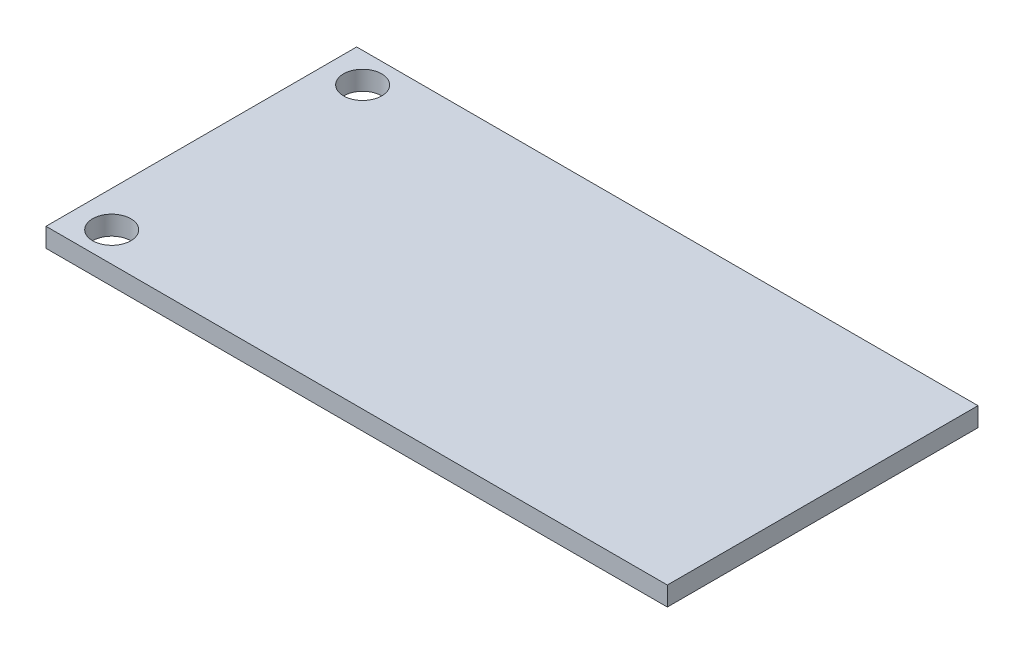
ISO-10303-21;
HEADER;
FILE_DESCRIPTION(('STEP AP214'),'2;1');
FILE_NAME('part.step','',(''),(''),'','','');
FILE_SCHEMA(('AUTOMOTIVE_DESIGN { 1 0 10303 214 1 1 1 1 }'));
ENDSEC;
DATA;
#1=APPLICATION_CONTEXT('core data for automotive mechanical design processes');
#2=APPLICATION_PROTOCOL_DEFINITION('international standard','automotive_design',2000,#1);
#3=PRODUCT_CONTEXT('',#1,'mechanical');
#4=PRODUCT('Part','Part','',(#3));
#5=PRODUCT_RELATED_PRODUCT_CATEGORY('part','',(#4));
#6=PRODUCT_DEFINITION_FORMATION('','',#4);
#7=PRODUCT_DEFINITION_CONTEXT('part definition',#1,'design');
#8=PRODUCT_DEFINITION('design','',#6,#7);
#9=PRODUCT_DEFINITION_SHAPE('','',#8);
#10=(LENGTH_UNIT() NAMED_UNIT(*) SI_UNIT(.MILLI.,.METRE.));
#11=(NAMED_UNIT(*) PLANE_ANGLE_UNIT() SI_UNIT($,.RADIAN.));
#12=(NAMED_UNIT(*) SI_UNIT($,.STERADIAN.) SOLID_ANGLE_UNIT());
#13=UNCERTAINTY_MEASURE_WITH_UNIT(LENGTH_MEASURE(1.E-05),#10,'distance_accuracy_value','');
#14=(GEOMETRIC_REPRESENTATION_CONTEXT(3) GLOBAL_UNCERTAINTY_ASSIGNED_CONTEXT((#13)) GLOBAL_UNIT_ASSIGNED_CONTEXT((#10,
#11,#12)) REPRESENTATION_CONTEXT('',''));
#15=CARTESIAN_POINT('',(0.,0.,0.));
#16=DIRECTION('',(0.,0.,1.));
#17=DIRECTION('',(1.,0.,0.));
#18=AXIS2_PLACEMENT_3D('',#15,#16,#17);
#19=CARTESIAN_POINT('',(0.,1.6,0.));
#20=DIRECTION('',(0.,-1.,0.));
#21=DIRECTION('',(0.,0.,-1.));
#22=AXIS2_PLACEMENT_3D('',#19,#20,#21);
#23=PLANE('',#22);
#24=CARTESIAN_POINT('',(3.,1.6,-23.5));
#25=DIRECTION('',(0.,1.,0.));
#26=DIRECTION('',(0.,0.,1.));
#27=AXIS2_PLACEMENT_3D('',#24,#25,#26);
#28=CIRCLE('',#27,1.6);
#29=CARTESIAN_POINT('',(3.,1.6,-21.9));
#30=VERTEX_POINT('',#29);
#31=EDGE_CURVE('E100',#30,#30,#28,.T.);
#32=ORIENTED_EDGE('',*,*,#31,.F.);
#33=EDGE_LOOP('',(#32));
#34=FACE_BOUND('',#33,.T.);
#35=DIRECTION('',(0.,0.,1.));
#36=VECTOR('',#35,1.);
#37=CARTESIAN_POINT('',(0.,1.6,0.));
#38=LINE('',#37,#36);
#39=CARTESIAN_POINT('',(0.,1.6,-26.));
#40=VERTEX_POINT('',#39);
#41=CARTESIAN_POINT('',(0.,1.6,0.));
#42=VERTEX_POINT('',#41);
#43=EDGE_CURVE('E85',#40,#42,#38,.T.);
#44=ORIENTED_EDGE('',*,*,#43,.T.);
#45=DIRECTION('',(1.,0.,0.));
#46=VECTOR('',#45,1.);
#47=CARTESIAN_POINT('',(0.,1.6,0.));
#48=LINE('',#47,#46);
#49=CARTESIAN_POINT('',(52.,1.6,0.));
#50=VERTEX_POINT('',#49);
#51=EDGE_CURVE('E80',#42,#50,#48,.T.);
#52=ORIENTED_EDGE('',*,*,#51,.T.);
#53=DIRECTION('',(0.,0.,-1.));
#54=VECTOR('',#53,1.);
#55=CARTESIAN_POINT('',(52.,1.6,0.));
#56=LINE('',#55,#54);
#57=CARTESIAN_POINT('',(52.,1.6,-26.));
#58=VERTEX_POINT('',#57);
#59=EDGE_CURVE('E83',#50,#58,#56,.T.);
#60=ORIENTED_EDGE('',*,*,#59,.T.);
#61=DIRECTION('',(-1.,0.,0.));
#62=VECTOR('',#61,1.);
#63=CARTESIAN_POINT('',(0.,1.6,-26.));
#64=LINE('',#63,#62);
#65=EDGE_CURVE('E50',#58,#40,#64,.T.);
#66=ORIENTED_EDGE('',*,*,#65,.T.);
#67=EDGE_LOOP('',(#44,#52,#60,#66));
#68=FACE_BOUND('',#67,.T.);
#69=CARTESIAN_POINT('',(3.,1.6,-2.5));
#70=DIRECTION('',(0.,1.,0.));
#71=DIRECTION('',(0.,0.,1.));
#72=AXIS2_PLACEMENT_3D('',#69,#70,#71);
#73=CIRCLE('',#72,1.6);
#74=CARTESIAN_POINT('',(3.,1.6,-0.9));
#75=VERTEX_POINT('',#74);
#76=EDGE_CURVE('E115',#75,#75,#73,.T.);
#77=ORIENTED_EDGE('',*,*,#76,.F.);
#78=EDGE_LOOP('',(#77));
#79=FACE_BOUND('',#78,.T.);
#80=ADVANCED_FACE('F33',(#34,#68,#79),#23,.F.);
#81=CARTESIAN_POINT('',(0.,0.,0.));
#82=DIRECTION('',(0.,-1.,0.));
#83=DIRECTION('',(0.,0.,-1.));
#84=AXIS2_PLACEMENT_3D('',#81,#82,#83);
#85=PLANE('',#84);
#86=CARTESIAN_POINT('',(3.,0.,-23.5));
#87=DIRECTION('',(0.,1.,0.));
#88=DIRECTION('',(0.,0.,1.));
#89=AXIS2_PLACEMENT_3D('',#86,#87,#88);
#90=CIRCLE('',#89,1.6);
#91=CARTESIAN_POINT('',(3.,0.,-21.9));
#92=VERTEX_POINT('',#91);
#93=EDGE_CURVE('E112',#92,#92,#90,.T.);
#94=ORIENTED_EDGE('',*,*,#93,.T.);
#95=EDGE_LOOP('',(#94));
#96=FACE_BOUND('',#95,.T.);
#97=DIRECTION('',(0.,0.,1.));
#98=VECTOR('',#97,1.);
#99=CARTESIAN_POINT('',(0.,0.,0.));
#100=LINE('',#99,#98);
#101=CARTESIAN_POINT('',(0.,0.,-26.));
#102=VERTEX_POINT('',#101);
#103=CARTESIAN_POINT('',(0.,0.,0.));
#104=VERTEX_POINT('',#103);
#105=EDGE_CURVE('E97',#102,#104,#100,.T.);
#106=ORIENTED_EDGE('',*,*,#105,.F.);
#107=DIRECTION('',(-1.,0.,0.));
#108=VECTOR('',#107,1.);
#109=CARTESIAN_POINT('',(0.,0.,-26.));
#110=LINE('',#109,#108);
#111=CARTESIAN_POINT('',(52.,0.,-26.));
#112=VERTEX_POINT('',#111);
#113=EDGE_CURVE('E73',#112,#102,#110,.T.);
#114=ORIENTED_EDGE('',*,*,#113,.F.);
#115=DIRECTION('',(0.,0.,-1.));
#116=VECTOR('',#115,1.);
#117=CARTESIAN_POINT('',(52.,0.,0.));
#118=LINE('',#117,#116);
#119=CARTESIAN_POINT('',(52.,0.,0.));
#120=VERTEX_POINT('',#119);
#121=EDGE_CURVE('E67',#120,#112,#118,.T.);
#122=ORIENTED_EDGE('',*,*,#121,.F.);
#123=DIRECTION('',(1.,0.,0.));
#124=VECTOR('',#123,1.);
#125=CARTESIAN_POINT('',(0.,0.,0.));
#126=LINE('',#125,#124);
#127=EDGE_CURVE('E89',#104,#120,#126,.T.);
#128=ORIENTED_EDGE('',*,*,#127,.F.);
#129=EDGE_LOOP('',(#106,#114,#122,#128));
#130=FACE_BOUND('',#129,.T.);
#131=CARTESIAN_POINT('',(3.,0.,-2.5));
#132=DIRECTION('',(0.,1.,0.));
#133=DIRECTION('',(0.,0.,1.));
#134=AXIS2_PLACEMENT_3D('',#131,#132,#133);
#135=CIRCLE('',#134,1.6);
#136=CARTESIAN_POINT('',(3.,0.,-0.9));
#137=VERTEX_POINT('',#136);
#138=EDGE_CURVE('E118',#137,#137,#135,.T.);
#139=ORIENTED_EDGE('',*,*,#138,.T.);
#140=EDGE_LOOP('',(#139));
#141=FACE_BOUND('',#140,.T.);
#142=ADVANCED_FACE('F108',(#96,#130,#141),#85,.T.);
#143=CARTESIAN_POINT('',(0.,1.6,0.));
#144=DIRECTION('',(1.,0.,0.));
#145=DIRECTION('',(0.,0.,-1.));
#146=AXIS2_PLACEMENT_3D('',#143,#144,#145);
#147=PLANE('',#146);
#148=ORIENTED_EDGE('',*,*,#105,.T.);
#149=DIRECTION('',(0.,-1.,0.));
#150=VECTOR('',#149,1.);
#151=CARTESIAN_POINT('',(0.,1.6,0.));
#152=LINE('',#151,#150);
#153=EDGE_CURVE('E11',#42,#104,#152,.T.);
#154=ORIENTED_EDGE('',*,*,#153,.F.);
#155=ORIENTED_EDGE('',*,*,#43,.F.);
#156=DIRECTION('',(0.,-1.,0.));
#157=VECTOR('',#156,1.);
#158=CARTESIAN_POINT('',(0.,1.6,-26.));
#159=LINE('',#158,#157);
#160=EDGE_CURVE('E93',#40,#102,#159,.T.);
#161=ORIENTED_EDGE('',*,*,#160,.T.);
#162=EDGE_LOOP('',(#148,#154,#155,#161));
#163=FACE_BOUND('',#162,.T.);
#164=ADVANCED_FACE('F35',(#163),#147,.F.);
#165=CARTESIAN_POINT('',(0.,1.6,0.));
#166=DIRECTION('',(0.,0.,-1.));
#167=DIRECTION('',(-1.,0.,0.));
#168=AXIS2_PLACEMENT_3D('',#165,#166,#167);
#169=PLANE('',#168);
#170=ORIENTED_EDGE('',*,*,#127,.T.);
#171=DIRECTION('',(0.,-1.,0.));
#172=VECTOR('',#171,1.);
#173=CARTESIAN_POINT('',(52.,1.6,0.));
#174=LINE('',#173,#172);
#175=EDGE_CURVE('E42',#50,#120,#174,.T.);
#176=ORIENTED_EDGE('',*,*,#175,.F.);
#177=ORIENTED_EDGE('',*,*,#51,.F.);
#178=ORIENTED_EDGE('',*,*,#153,.T.);
#179=EDGE_LOOP('',(#170,#176,#177,#178));
#180=FACE_BOUND('',#179,.T.);
#181=ADVANCED_FACE('F88',(#180),#169,.F.);
#182=CARTESIAN_POINT('',(52.,1.6,0.));
#183=DIRECTION('',(-1.,0.,0.));
#184=DIRECTION('',(0.,0.,1.));
#185=AXIS2_PLACEMENT_3D('',#182,#183,#184);
#186=PLANE('',#185);
#187=ORIENTED_EDGE('',*,*,#121,.T.);
#188=DIRECTION('',(0.,-1.,0.));
#189=VECTOR('',#188,1.);
#190=CARTESIAN_POINT('',(52.,1.6,-26.));
#191=LINE('',#190,#189);
#192=EDGE_CURVE('E90',#58,#112,#191,.T.);
#193=ORIENTED_EDGE('',*,*,#192,.F.);
#194=ORIENTED_EDGE('',*,*,#59,.F.);
#195=ORIENTED_EDGE('',*,*,#175,.T.);
#196=EDGE_LOOP('',(#187,#193,#194,#195));
#197=FACE_BOUND('',#196,.T.);
#198=ADVANCED_FACE('F91',(#197),#186,.F.);
#199=CARTESIAN_POINT('',(0.,1.6,-26.));
#200=DIRECTION('',(0.,0.,1.));
#201=DIRECTION('',(1.,0.,0.));
#202=AXIS2_PLACEMENT_3D('',#199,#200,#201);
#203=PLANE('',#202);
#204=ORIENTED_EDGE('',*,*,#113,.T.);
#205=ORIENTED_EDGE('',*,*,#160,.F.);
#206=ORIENTED_EDGE('',*,*,#65,.F.);
#207=ORIENTED_EDGE('',*,*,#192,.T.);
#208=EDGE_LOOP('',(#204,#205,#206,#207));
#209=FACE_BOUND('',#208,.T.);
#210=ADVANCED_FACE('F105',(#209),#203,.F.);
#211=CARTESIAN_POINT('',(3.,1.6,-23.5));
#212=DIRECTION('',(0.,-1.,0.));
#213=DIRECTION('',(0.,0.,-1.));
#214=AXIS2_PLACEMENT_3D('',#211,#212,#213);
#215=CYLINDRICAL_SURFACE('',#214,1.6);
#216=ORIENTED_EDGE('',*,*,#31,.T.);
#217=EDGE_LOOP('',(#216));
#218=FACE_BOUND('',#217,.T.);
#219=ORIENTED_EDGE('',*,*,#93,.F.);
#220=EDGE_LOOP('',(#219));
#221=FACE_BOUND('',#220,.T.);
#222=ADVANCED_FACE('F136',(#218,#221),#215,.F.);
#223=CARTESIAN_POINT('',(3.,1.6,-2.5));
#224=DIRECTION('',(0.,-1.,0.));
#225=DIRECTION('',(0.,0.,-1.));
#226=AXIS2_PLACEMENT_3D('',#223,#224,#225);
#227=CYLINDRICAL_SURFACE('',#226,1.6);
#228=ORIENTED_EDGE('',*,*,#76,.T.);
#229=EDGE_LOOP('',(#228));
#230=FACE_BOUND('',#229,.T.);
#231=ORIENTED_EDGE('',*,*,#138,.F.);
#232=EDGE_LOOP('',(#231));
#233=FACE_BOUND('',#232,.T.);
#234=ADVANCED_FACE('F124',(#230,#233),#227,.F.);
#235=CLOSED_SHELL('',(#80,#142,#164,#181,#198,#210,#222,#234));
#236=MANIFOLD_SOLID_BREP('B2',#235);
#237=ADVANCED_BREP_SHAPE_REPRESENTATION('',(#18,#236),#14);
#238=SHAPE_DEFINITION_REPRESENTATION(#9,#237);
ENDSEC;
END-ISO-10303-21;
